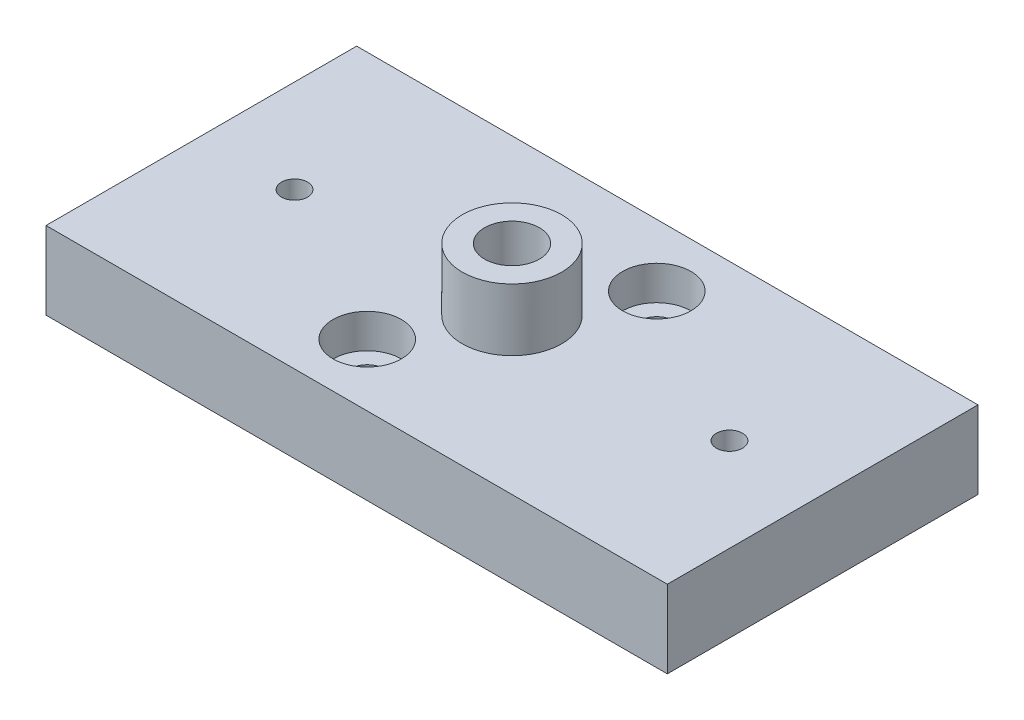
ISO-10303-21;
HEADER;
FILE_DESCRIPTION(('STEP AP214'),'2;1');
FILE_NAME('part.step','',(''),(''),'','','');
FILE_SCHEMA(('AUTOMOTIVE_DESIGN { 1 0 10303 214 1 1 1 1 }'));
ENDSEC;
DATA;
#1=APPLICATION_CONTEXT('core data for automotive mechanical design processes');
#2=APPLICATION_PROTOCOL_DEFINITION('international standard','automotive_design',2000,#1);
#3=PRODUCT_CONTEXT('',#1,'mechanical');
#4=PRODUCT('Part','Part','',(#3));
#5=PRODUCT_RELATED_PRODUCT_CATEGORY('part','',(#4));
#6=PRODUCT_DEFINITION_FORMATION('','',#4);
#7=PRODUCT_DEFINITION_CONTEXT('part definition',#1,'design');
#8=PRODUCT_DEFINITION('design','',#6,#7);
#9=PRODUCT_DEFINITION_SHAPE('','',#8);
#10=(LENGTH_UNIT() NAMED_UNIT(*) SI_UNIT(.MILLI.,.METRE.));
#11=(NAMED_UNIT(*) PLANE_ANGLE_UNIT() SI_UNIT($,.RADIAN.));
#12=(NAMED_UNIT(*) SI_UNIT($,.STERADIAN.) SOLID_ANGLE_UNIT());
#13=UNCERTAINTY_MEASURE_WITH_UNIT(LENGTH_MEASURE(1.E-05),#10,'distance_accuracy_value','');
#14=(GEOMETRIC_REPRESENTATION_CONTEXT(3) GLOBAL_UNCERTAINTY_ASSIGNED_CONTEXT((#13)) GLOBAL_UNIT_ASSIGNED_CONTEXT((#10,
#11,#12)) REPRESENTATION_CONTEXT('',''));
#15=CARTESIAN_POINT('',(0.,0.,0.));
#16=DIRECTION('',(0.,0.,1.));
#17=DIRECTION('',(1.,0.,0.));
#18=AXIS2_PLACEMENT_3D('',#15,#16,#17);
#19=CARTESIAN_POINT('',(-8.3000000003173,22.5,14.9999999998244));
#20=DIRECTION('',(0.,-1.,0.));
#21=DIRECTION('',(0.,0.,-1.));
#22=AXIS2_PLACEMENT_3D('',#19,#20,#21);
#23=CYLINDRICAL_SURFACE('',#22,2.75);
#24=CARTESIAN_POINT('',(-8.3000000003173,0.,14.9999999998244));
#25=DIRECTION('',(0.,-1.,0.));
#26=DIRECTION('',(0.,0.,-1.));
#27=AXIS2_PLACEMENT_3D('',#24,#25,#26);
#28=CIRCLE('',#27,2.75);
#29=CARTESIAN_POINT('',(-8.3000000003173,0.,12.2499999998244));
#30=VERTEX_POINT('',#29);
#31=EDGE_CURVE('E190',#30,#30,#28,.T.);
#32=ORIENTED_EDGE('',*,*,#31,.T.);
#33=EDGE_LOOP('',(#32));
#34=FACE_BOUND('',#33,.T.);
#35=CARTESIAN_POINT('',(-8.3000000003173,7.00000000000001,14.9999999998244));
#36=DIRECTION('',(0.,1.,0.));
#37=DIRECTION('',(0.,0.,1.));
#38=AXIS2_PLACEMENT_3D('',#35,#36,#37);
#39=CIRCLE('',#38,2.75);
#40=CARTESIAN_POINT('',(-8.3000000003173,7.00000000000001,17.7499999998244));
#41=VERTEX_POINT('',#40);
#42=EDGE_CURVE('E51',#41,#41,#39,.F.);
#43=ORIENTED_EDGE('',*,*,#42,.F.);
#44=EDGE_LOOP('',(#43));
#45=FACE_BOUND('',#44,.T.);
#46=ADVANCED_FACE('F47',(#34,#45),#23,.F.);
#47=CARTESIAN_POINT('',(8.3000000003173,22.5,-14.9999999998244));
#48=DIRECTION('',(0.,-1.,0.));
#49=DIRECTION('',(0.,0.,-1.));
#50=AXIS2_PLACEMENT_3D('',#47,#48,#49);
#51=CYLINDRICAL_SURFACE('',#50,2.75);
#52=CARTESIAN_POINT('',(8.3000000003173,0.,-14.9999999998244));
#53=DIRECTION('',(0.,-1.,0.));
#54=DIRECTION('',(0.,0.,-1.));
#55=AXIS2_PLACEMENT_3D('',#52,#53,#54);
#56=CIRCLE('',#55,2.75);
#57=CARTESIAN_POINT('',(8.3000000003173,0.,-17.7499999998244));
#58=VERTEX_POINT('',#57);
#59=EDGE_CURVE('E130',#58,#58,#56,.T.);
#60=ORIENTED_EDGE('',*,*,#59,.T.);
#61=EDGE_LOOP('',(#60));
#62=FACE_BOUND('',#61,.T.);
#63=CARTESIAN_POINT('',(8.3000000003173,7.00000000000001,-14.9999999998244));
#64=DIRECTION('',(0.,1.,0.));
#65=DIRECTION('',(0.,0.,1.));
#66=AXIS2_PLACEMENT_3D('',#63,#64,#65);
#67=CIRCLE('',#66,2.75);
#68=CARTESIAN_POINT('',(8.3000000003173,7.00000000000001,-12.2499999998244));
#69=VERTEX_POINT('',#68);
#70=EDGE_CURVE('E180',#69,#69,#67,.F.);
#71=ORIENTED_EDGE('',*,*,#70,.F.);
#72=EDGE_LOOP('',(#71));
#73=FACE_BOUND('',#72,.T.);
#74=ADVANCED_FACE('F239',(#62,#73),#51,.F.);
#75=CARTESIAN_POINT('',(50.,12.5,25.));
#76=DIRECTION('',(-1.,0.,0.));
#77=DIRECTION('',(0.,0.,1.));
#78=AXIS2_PLACEMENT_3D('',#75,#76,#77);
#79=PLANE('',#78);
#80=DIRECTION('',(0.,0.,-1.));
#81=VECTOR('',#80,1.);
#82=CARTESIAN_POINT('',(50.,0.,25.));
#83=LINE('',#82,#81);
#84=CARTESIAN_POINT('',(50.,0.,25.));
#85=VERTEX_POINT('',#84);
#86=CARTESIAN_POINT('',(50.,0.,-25.));
#87=VERTEX_POINT('',#86);
#88=EDGE_CURVE('E149',#85,#87,#83,.T.);
#89=ORIENTED_EDGE('',*,*,#88,.T.);
#90=DIRECTION('',(0.,-1.,0.));
#91=VECTOR('',#90,1.);
#92=CARTESIAN_POINT('',(50.,12.5,-25.));
#93=LINE('',#92,#91);
#94=CARTESIAN_POINT('',(50.,12.5,-25.));
#95=VERTEX_POINT('',#94);
#96=EDGE_CURVE('E58',#95,#87,#93,.T.);
#97=ORIENTED_EDGE('',*,*,#96,.F.);
#98=DIRECTION('',(0.,0.,-1.));
#99=VECTOR('',#98,1.);
#100=CARTESIAN_POINT('',(50.,12.5,25.));
#101=LINE('',#100,#99);
#102=CARTESIAN_POINT('',(50.,12.5,25.));
#103=VERTEX_POINT('',#102);
#104=EDGE_CURVE('E150',#103,#95,#101,.T.);
#105=ORIENTED_EDGE('',*,*,#104,.F.);
#106=DIRECTION('',(0.,-1.,0.));
#107=VECTOR('',#106,1.);
#108=CARTESIAN_POINT('',(50.,12.5,25.));
#109=LINE('',#108,#107);
#110=EDGE_CURVE('E160',#103,#85,#109,.T.);
#111=ORIENTED_EDGE('',*,*,#110,.T.);
#112=EDGE_LOOP('',(#89,#97,#105,#111));
#113=FACE_BOUND('',#112,.T.);
#114=ADVANCED_FACE('F49',(#113),#79,.F.);
#115=CARTESIAN_POINT('',(-50.,12.5,-25.));
#116=DIRECTION('',(0.,0.,1.));
#117=DIRECTION('',(1.,0.,0.));
#118=AXIS2_PLACEMENT_3D('',#115,#116,#117);
#119=PLANE('',#118);
#120=DIRECTION('',(-1.,0.,0.));
#121=VECTOR('',#120,1.);
#122=CARTESIAN_POINT('',(-50.,0.,-25.));
#123=LINE('',#122,#121);
#124=CARTESIAN_POINT('',(-50.,0.,-25.));
#125=VERTEX_POINT('',#124);
#126=EDGE_CURVE('E164',#87,#125,#123,.T.);
#127=ORIENTED_EDGE('',*,*,#126,.T.);
#128=DIRECTION('',(0.,-1.,0.));
#129=VECTOR('',#128,1.);
#130=CARTESIAN_POINT('',(-50.,12.5,-25.));
#131=LINE('',#130,#129);
#132=CARTESIAN_POINT('',(-50.,12.5,-25.));
#133=VERTEX_POINT('',#132);
#134=EDGE_CURVE('E176',#133,#125,#131,.T.);
#135=ORIENTED_EDGE('',*,*,#134,.F.);
#136=DIRECTION('',(-1.,0.,0.));
#137=VECTOR('',#136,1.);
#138=CARTESIAN_POINT('',(-50.,12.5,-25.));
#139=LINE('',#138,#137);
#140=EDGE_CURVE('E99',#95,#133,#139,.T.);
#141=ORIENTED_EDGE('',*,*,#140,.F.);
#142=ORIENTED_EDGE('',*,*,#96,.T.);
#143=EDGE_LOOP('',(#127,#135,#141,#142));
#144=FACE_BOUND('',#143,.T.);
#145=ADVANCED_FACE('F232',(#144),#119,.F.);
#146=CARTESIAN_POINT('',(-50.,12.5,25.));
#147=DIRECTION('',(1.,0.,0.));
#148=DIRECTION('',(0.,0.,-1.));
#149=AXIS2_PLACEMENT_3D('',#146,#147,#148);
#150=PLANE('',#149);
#151=DIRECTION('',(0.,0.,1.));
#152=VECTOR('',#151,1.);
#153=CARTESIAN_POINT('',(-50.,0.,25.));
#154=LINE('',#153,#152);
#155=CARTESIAN_POINT('',(-50.,0.,25.));
#156=VERTEX_POINT('',#155);
#157=EDGE_CURVE('E85',#125,#156,#154,.T.);
#158=ORIENTED_EDGE('',*,*,#157,.T.);
#159=DIRECTION('',(0.,-1.,0.));
#160=VECTOR('',#159,1.);
#161=CARTESIAN_POINT('',(-50.,12.5,25.));
#162=LINE('',#161,#160);
#163=CARTESIAN_POINT('',(-50.,12.5,25.));
#164=VERTEX_POINT('',#163);
#165=EDGE_CURVE('E173',#164,#156,#162,.T.);
#166=ORIENTED_EDGE('',*,*,#165,.F.);
#167=DIRECTION('',(0.,0.,1.));
#168=VECTOR('',#167,1.);
#169=CARTESIAN_POINT('',(-50.,12.5,25.));
#170=LINE('',#169,#168);
#171=EDGE_CURVE('E155',#133,#164,#170,.T.);
#172=ORIENTED_EDGE('',*,*,#171,.F.);
#173=ORIENTED_EDGE('',*,*,#134,.T.);
#174=EDGE_LOOP('',(#158,#166,#172,#173));
#175=FACE_BOUND('',#174,.T.);
#176=ADVANCED_FACE('F231',(#175),#150,.F.);
#177=CARTESIAN_POINT('',(-50.,12.5,25.));
#178=DIRECTION('',(0.,0.,-1.));
#179=DIRECTION('',(-1.,0.,0.));
#180=AXIS2_PLACEMENT_3D('',#177,#178,#179);
#181=PLANE('',#180);
#182=DIRECTION('',(1.,0.,0.));
#183=VECTOR('',#182,1.);
#184=CARTESIAN_POINT('',(-50.,0.,25.));
#185=LINE('',#184,#183);
#186=EDGE_CURVE('E91',#156,#85,#185,.T.);
#187=ORIENTED_EDGE('',*,*,#186,.T.);
#188=ORIENTED_EDGE('',*,*,#110,.F.);
#189=DIRECTION('',(1.,0.,0.));
#190=VECTOR('',#189,1.);
#191=CARTESIAN_POINT('',(-50.,12.5,25.));
#192=LINE('',#191,#190);
#193=EDGE_CURVE('E67',#164,#103,#192,.T.);
#194=ORIENTED_EDGE('',*,*,#193,.F.);
#195=ORIENTED_EDGE('',*,*,#165,.T.);
#196=EDGE_LOOP('',(#187,#188,#194,#195));
#197=FACE_BOUND('',#196,.T.);
#198=ADVANCED_FACE('F229',(#197),#181,.F.);
#199=CARTESIAN_POINT('',(0.,12.5,0.));
#200=DIRECTION('',(0.,-1.,0.));
#201=DIRECTION('',(0.,0.,-1.));
#202=AXIS2_PLACEMENT_3D('',#199,#200,#201);
#203=PLANE('',#202);
#204=CARTESIAN_POINT('',(8.3000000003173,12.5,-14.9999999998244));
#205=DIRECTION('',(0.,1.,0.));
#206=DIRECTION('',(0.,0.,1.));
#207=AXIS2_PLACEMENT_3D('',#204,#205,#206);
#208=CIRCLE('',#207,5.5);
#209=CARTESIAN_POINT('',(8.3000000003173,12.5,-9.49999999982438));
#210=VERTEX_POINT('',#209);
#211=EDGE_CURVE('E192',#210,#210,#208,.T.);
#212=ORIENTED_EDGE('',*,*,#211,.F.);
#213=EDGE_LOOP('',(#212));
#214=FACE_BOUND('',#213,.T.);
#215=CARTESIAN_POINT('',(-8.3000000003173,12.5,14.9999999998244));
#216=DIRECTION('',(0.,1.,0.));
#217=DIRECTION('',(0.,0.,1.));
#218=AXIS2_PLACEMENT_3D('',#215,#216,#217);
#219=CIRCLE('',#218,5.5);
#220=CARTESIAN_POINT('',(-8.3000000003173,12.5,20.4999999998244));
#221=VERTEX_POINT('',#220);
#222=EDGE_CURVE('E205',#221,#221,#219,.T.);
#223=ORIENTED_EDGE('',*,*,#222,.F.);
#224=EDGE_LOOP('',(#223));
#225=FACE_BOUND('',#224,.T.);
#226=CARTESIAN_POINT('',(-35.,12.5,0.));
#227=DIRECTION('',(0.,1.,0.));
#228=DIRECTION('',(0.,0.,1.));
#229=AXIS2_PLACEMENT_3D('',#226,#227,#228);
#230=CIRCLE('',#229,2.1);
#231=CARTESIAN_POINT('',(-35.,12.5,2.1));
#232=VERTEX_POINT('',#231);
#233=EDGE_CURVE('E121',#232,#232,#230,.T.);
#234=ORIENTED_EDGE('',*,*,#233,.F.);
#235=EDGE_LOOP('',(#234));
#236=FACE_BOUND('',#235,.T.);
#237=CARTESIAN_POINT('',(35.,12.5,0.));
#238=DIRECTION('',(0.,1.,0.));
#239=DIRECTION('',(0.,0.,1.));
#240=AXIS2_PLACEMENT_3D('',#237,#238,#239);
#241=CIRCLE('',#240,2.1);
#242=CARTESIAN_POINT('',(35.,12.5,2.1));
#243=VERTEX_POINT('',#242);
#244=EDGE_CURVE('E120',#243,#243,#241,.T.);
#245=ORIENTED_EDGE('',*,*,#244,.F.);
#246=EDGE_LOOP('',(#245));
#247=FACE_BOUND('',#246,.T.);
#248=CARTESIAN_POINT('',(0.,12.5,0.));
#249=DIRECTION('',(0.,-1.,0.));
#250=DIRECTION('',(0.,0.,-1.));
#251=AXIS2_PLACEMENT_3D('',#248,#249,#250);
#252=CIRCLE('',#251,8.);
#253=CARTESIAN_POINT('',(0.,12.5,-8.));
#254=VERTEX_POINT('',#253);
#255=EDGE_CURVE('E11',#254,#254,#252,.F.);
#256=ORIENTED_EDGE('',*,*,#255,.F.);
#257=EDGE_LOOP('',(#256));
#258=FACE_BOUND('',#257,.T.);
#259=ORIENTED_EDGE('',*,*,#104,.T.);
#260=ORIENTED_EDGE('',*,*,#140,.T.);
#261=ORIENTED_EDGE('',*,*,#171,.T.);
#262=ORIENTED_EDGE('',*,*,#193,.T.);
#263=EDGE_LOOP('',(#259,#260,#261,#262));
#264=FACE_BOUND('',#263,.T.);
#265=ADVANCED_FACE('F222',(#214,#225,#236,#247,#258,#264),#203,.F.);
#266=CARTESIAN_POINT('',(0.,0.,0.));
#267=DIRECTION('',(0.,-1.,0.));
#268=DIRECTION('',(0.,0.,-1.));
#269=AXIS2_PLACEMENT_3D('',#266,#267,#268);
#270=PLANE('',#269);
#271=ORIENTED_EDGE('',*,*,#59,.F.);
#272=EDGE_LOOP('',(#271));
#273=FACE_BOUND('',#272,.T.);
#274=ORIENTED_EDGE('',*,*,#31,.F.);
#275=EDGE_LOOP('',(#274));
#276=FACE_BOUND('',#275,.T.);
#277=ORIENTED_EDGE('',*,*,#88,.F.);
#278=ORIENTED_EDGE('',*,*,#186,.F.);
#279=ORIENTED_EDGE('',*,*,#157,.F.);
#280=ORIENTED_EDGE('',*,*,#126,.F.);
#281=EDGE_LOOP('',(#277,#278,#279,#280));
#282=FACE_BOUND('',#281,.T.);
#283=ADVANCED_FACE('F218',(#273,#276,#282),#270,.T.);
#284=CARTESIAN_POINT('',(0.,22.5,0.));
#285=DIRECTION('',(0.,-1.,0.));
#286=DIRECTION('',(0.,0.,-1.));
#287=AXIS2_PLACEMENT_3D('',#284,#285,#286);
#288=CYLINDRICAL_SURFACE('',#287,8.);
#289=CARTESIAN_POINT('',(0.,22.5,0.));
#290=DIRECTION('',(0.,1.,0.));
#291=DIRECTION('',(0.,0.,1.));
#292=AXIS2_PLACEMENT_3D('',#289,#290,#291);
#293=CIRCLE('',#292,8.);
#294=CARTESIAN_POINT('',(0.,22.5,8.));
#295=VERTEX_POINT('',#294);
#296=EDGE_CURVE('E145',#295,#295,#293,.T.);
#297=ORIENTED_EDGE('',*,*,#296,.F.);
#298=EDGE_LOOP('',(#297));
#299=FACE_BOUND('',#298,.T.);
#300=ORIENTED_EDGE('',*,*,#255,.T.);
#301=EDGE_LOOP('',(#300));
#302=FACE_BOUND('',#301,.T.);
#303=ADVANCED_FACE('F221',(#299,#302),#288,.T.);
#304=CARTESIAN_POINT('',(0.,22.5,0.));
#305=DIRECTION('',(0.,1.,0.));
#306=DIRECTION('',(0.,0.,1.));
#307=AXIS2_PLACEMENT_3D('',#304,#305,#306);
#308=PLANE('',#307);
#309=CARTESIAN_POINT('',(0.,22.5,0.));
#310=DIRECTION('',(0.,1.,0.));
#311=DIRECTION('',(0.,0.,1.));
#312=AXIS2_PLACEMENT_3D('',#309,#310,#311);
#313=CIRCLE('',#312,4.4);
#314=CARTESIAN_POINT('',(0.,22.5,4.4));
#315=VERTEX_POINT('',#314);
#316=EDGE_CURVE('E137',#315,#315,#313,.T.);
#317=ORIENTED_EDGE('',*,*,#316,.F.);
#318=EDGE_LOOP('',(#317));
#319=FACE_BOUND('',#318,.T.);
#320=ORIENTED_EDGE('',*,*,#296,.T.);
#321=EDGE_LOOP('',(#320));
#322=FACE_BOUND('',#321,.T.);
#323=ADVANCED_FACE('F266',(#319,#322),#308,.T.);
#324=CARTESIAN_POINT('',(0.,9.50000000000001,0.));
#325=DIRECTION('',(0.,1.,0.));
#326=DIRECTION('',(0.,0.,1.));
#327=AXIS2_PLACEMENT_3D('',#324,#325,#326);
#328=CONICAL_SURFACE('',#327,4.4,1.02974425867665);
#329=CARTESIAN_POINT('',(0.,6.85621327627872,0.));
#330=VERTEX_POINT('',#329);
#331=VERTEX_LOOP('',#330);
#332=FACE_BOUND('',#331,.T.);
#333=CARTESIAN_POINT('',(0.,9.50000000000001,0.));
#334=DIRECTION('',(0.,1.,0.));
#335=DIRECTION('',(0.,0.,1.));
#336=AXIS2_PLACEMENT_3D('',#333,#334,#335);
#337=CIRCLE('',#336,4.4);
#338=CARTESIAN_POINT('',(0.,9.50000000000001,4.4));
#339=VERTEX_POINT('',#338);
#340=EDGE_CURVE('E141',#339,#339,#337,.T.);
#341=ORIENTED_EDGE('',*,*,#340,.T.);
#342=EDGE_LOOP('',(#341));
#343=FACE_BOUND('',#342,.T.);
#344=ADVANCED_FACE('F262',(#332,#343),#328,.F.);
#345=CARTESIAN_POINT('',(0.,22.5,0.));
#346=DIRECTION('',(0.,1.,0.));
#347=DIRECTION('',(0.,0.,1.));
#348=AXIS2_PLACEMENT_3D('',#345,#346,#347);
#349=CYLINDRICAL_SURFACE('',#348,4.4);
#350=ORIENTED_EDGE('',*,*,#340,.F.);
#351=EDGE_LOOP('',(#350));
#352=FACE_BOUND('',#351,.T.);
#353=ORIENTED_EDGE('',*,*,#316,.T.);
#354=EDGE_LOOP('',(#353));
#355=FACE_BOUND('',#354,.T.);
#356=ADVANCED_FACE('F258',(#352,#355),#349,.F.);
#357=CARTESIAN_POINT('',(35.,2.5,0.));
#358=DIRECTION('',(0.,1.,0.));
#359=DIRECTION('',(0.,0.,1.));
#360=AXIS2_PLACEMENT_3D('',#357,#358,#359);
#361=CONICAL_SURFACE('',#360,2.1,1.02974425867665);
#362=CARTESIAN_POINT('',(35.,1.23819270004211,0.));
#363=VERTEX_POINT('',#362);
#364=VERTEX_LOOP('',#363);
#365=FACE_BOUND('',#364,.T.);
#366=CARTESIAN_POINT('',(35.,2.5,0.));
#367=DIRECTION('',(0.,1.,0.));
#368=DIRECTION('',(0.,0.,1.));
#369=AXIS2_PLACEMENT_3D('',#366,#367,#368);
#370=CIRCLE('',#369,2.1);
#371=CARTESIAN_POINT('',(35.,2.5,2.1));
#372=VERTEX_POINT('',#371);
#373=EDGE_CURVE('E127',#372,#372,#370,.T.);
#374=ORIENTED_EDGE('',*,*,#373,.T.);
#375=EDGE_LOOP('',(#374));
#376=FACE_BOUND('',#375,.T.);
#377=ADVANCED_FACE('F254',(#365,#376),#361,.F.);
#378=CARTESIAN_POINT('',(35.,12.5,0.));
#379=DIRECTION('',(0.,1.,0.));
#380=DIRECTION('',(0.,0.,1.));
#381=AXIS2_PLACEMENT_3D('',#378,#379,#380);
#382=CYLINDRICAL_SURFACE('',#381,2.1);
#383=ORIENTED_EDGE('',*,*,#373,.F.);
#384=EDGE_LOOP('',(#383));
#385=FACE_BOUND('',#384,.T.);
#386=ORIENTED_EDGE('',*,*,#244,.T.);
#387=EDGE_LOOP('',(#386));
#388=FACE_BOUND('',#387,.T.);
#389=ADVANCED_FACE('F113',(#385,#388),#382,.F.);
#390=CARTESIAN_POINT('',(-35.,2.5,0.));
#391=DIRECTION('',(0.,1.,0.));
#392=DIRECTION('',(0.,0.,1.));
#393=AXIS2_PLACEMENT_3D('',#390,#391,#392);
#394=CONICAL_SURFACE('',#393,2.1,1.02974425867665);
#395=CARTESIAN_POINT('',(-35.,1.23819270004211,0.));
#396=VERTEX_POINT('',#395);
#397=VERTEX_LOOP('',#396);
#398=FACE_BOUND('',#397,.T.);
#399=CARTESIAN_POINT('',(-35.,2.5,0.));
#400=DIRECTION('',(0.,1.,0.));
#401=DIRECTION('',(0.,0.,1.));
#402=AXIS2_PLACEMENT_3D('',#399,#400,#401);
#403=CIRCLE('',#402,2.1);
#404=CARTESIAN_POINT('',(-35.,2.5,2.1));
#405=VERTEX_POINT('',#404);
#406=EDGE_CURVE('E117',#405,#405,#403,.T.);
#407=ORIENTED_EDGE('',*,*,#406,.T.);
#408=EDGE_LOOP('',(#407));
#409=FACE_BOUND('',#408,.T.);
#410=ADVANCED_FACE('F109',(#398,#409),#394,.F.);
#411=CARTESIAN_POINT('',(-35.,12.5,0.));
#412=DIRECTION('',(0.,1.,0.));
#413=DIRECTION('',(0.,0.,1.));
#414=AXIS2_PLACEMENT_3D('',#411,#412,#413);
#415=CYLINDRICAL_SURFACE('',#414,2.1);
#416=ORIENTED_EDGE('',*,*,#406,.F.);
#417=EDGE_LOOP('',(#416));
#418=FACE_BOUND('',#417,.T.);
#419=ORIENTED_EDGE('',*,*,#233,.T.);
#420=EDGE_LOOP('',(#419));
#421=FACE_BOUND('',#420,.T.);
#422=ADVANCED_FACE('F112',(#418,#421),#415,.F.);
#423=CARTESIAN_POINT('',(8.3000000003173,7.00000000000001,-14.9999999998244));
#424=DIRECTION('',(0.,1.,0.));
#425=DIRECTION('',(0.,0.,1.));
#426=AXIS2_PLACEMENT_3D('',#423,#424,#425);
#427=PLANE('',#426);
#428=CARTESIAN_POINT('',(8.3000000003173,7.00000000000001,-14.9999999998244));
#429=DIRECTION('',(0.,1.,0.));
#430=DIRECTION('',(0.,0.,1.));
#431=AXIS2_PLACEMENT_3D('',#428,#429,#430);
#432=CIRCLE('',#431,5.5);
#433=CARTESIAN_POINT('',(8.3000000003173,7.00000000000001,-9.49999999982438));
#434=VERTEX_POINT('',#433);
#435=EDGE_CURVE('E183',#434,#434,#432,.T.);
#436=ORIENTED_EDGE('',*,*,#435,.T.);
#437=EDGE_LOOP('',(#436));
#438=FACE_BOUND('',#437,.T.);
#439=ORIENTED_EDGE('',*,*,#70,.T.);
#440=EDGE_LOOP('',(#439));
#441=FACE_BOUND('',#440,.T.);
#442=ADVANCED_FACE('F250',(#438,#441),#427,.T.);
#443=CARTESIAN_POINT('',(8.3000000003173,7.00000000000001,-14.9999999998244));
#444=DIRECTION('',(0.,1.,0.));
#445=DIRECTION('',(0.,0.,1.));
#446=AXIS2_PLACEMENT_3D('',#443,#444,#445);
#447=CYLINDRICAL_SURFACE('',#446,5.5);
#448=ORIENTED_EDGE('',*,*,#435,.F.);
#449=EDGE_LOOP('',(#448));
#450=FACE_BOUND('',#449,.T.);
#451=ORIENTED_EDGE('',*,*,#211,.T.);
#452=EDGE_LOOP('',(#451));
#453=FACE_BOUND('',#452,.T.);
#454=ADVANCED_FACE('F328',(#450,#453),#447,.F.);
#455=CARTESIAN_POINT('',(-8.3000000003173,7.00000000000001,14.9999999998244));
#456=DIRECTION('',(0.,1.,0.));
#457=DIRECTION('',(0.,0.,1.));
#458=AXIS2_PLACEMENT_3D('',#455,#456,#457);
#459=PLANE('',#458);
#460=CARTESIAN_POINT('',(-8.3000000003173,7.00000000000001,14.9999999998244));
#461=DIRECTION('',(0.,1.,0.));
#462=DIRECTION('',(0.,0.,1.));
#463=AXIS2_PLACEMENT_3D('',#460,#461,#462);
#464=CIRCLE('',#463,5.5);
#465=CARTESIAN_POINT('',(-8.3000000003173,7.00000000000001,20.4999999998244));
#466=VERTEX_POINT('',#465);
#467=EDGE_CURVE('E199',#466,#466,#464,.T.);
#468=ORIENTED_EDGE('',*,*,#467,.T.);
#469=EDGE_LOOP('',(#468));
#470=FACE_BOUND('',#469,.T.);
#471=ORIENTED_EDGE('',*,*,#42,.T.);
#472=EDGE_LOOP('',(#471));
#473=FACE_BOUND('',#472,.T.);
#474=ADVANCED_FACE('F335',(#470,#473),#459,.T.);
#475=CARTESIAN_POINT('',(-8.3000000003173,7.00000000000001,14.9999999998244));
#476=DIRECTION('',(0.,1.,0.));
#477=DIRECTION('',(0.,0.,1.));
#478=AXIS2_PLACEMENT_3D('',#475,#476,#477);
#479=CYLINDRICAL_SURFACE('',#478,5.5);
#480=ORIENTED_EDGE('',*,*,#467,.F.);
#481=EDGE_LOOP('',(#480));
#482=FACE_BOUND('',#481,.T.);
#483=ORIENTED_EDGE('',*,*,#222,.T.);
#484=EDGE_LOOP('',(#483));
#485=FACE_BOUND('',#484,.T.);
#486=ADVANCED_FACE('F343',(#482,#485),#479,.F.);
#487=CLOSED_SHELL('',(#46,#74,#114,#145,#176,#198,#265,#283,#303,#323,#344,#356,#377,#389,#410,
#422,#442,#454,#474,#486));
#488=MANIFOLD_SOLID_BREP('B2',#487);
#489=ADVANCED_BREP_SHAPE_REPRESENTATION('',(#18,#488),#14);
#490=SHAPE_DEFINITION_REPRESENTATION(#9,#489);
ENDSEC;
END-ISO-10303-21;
